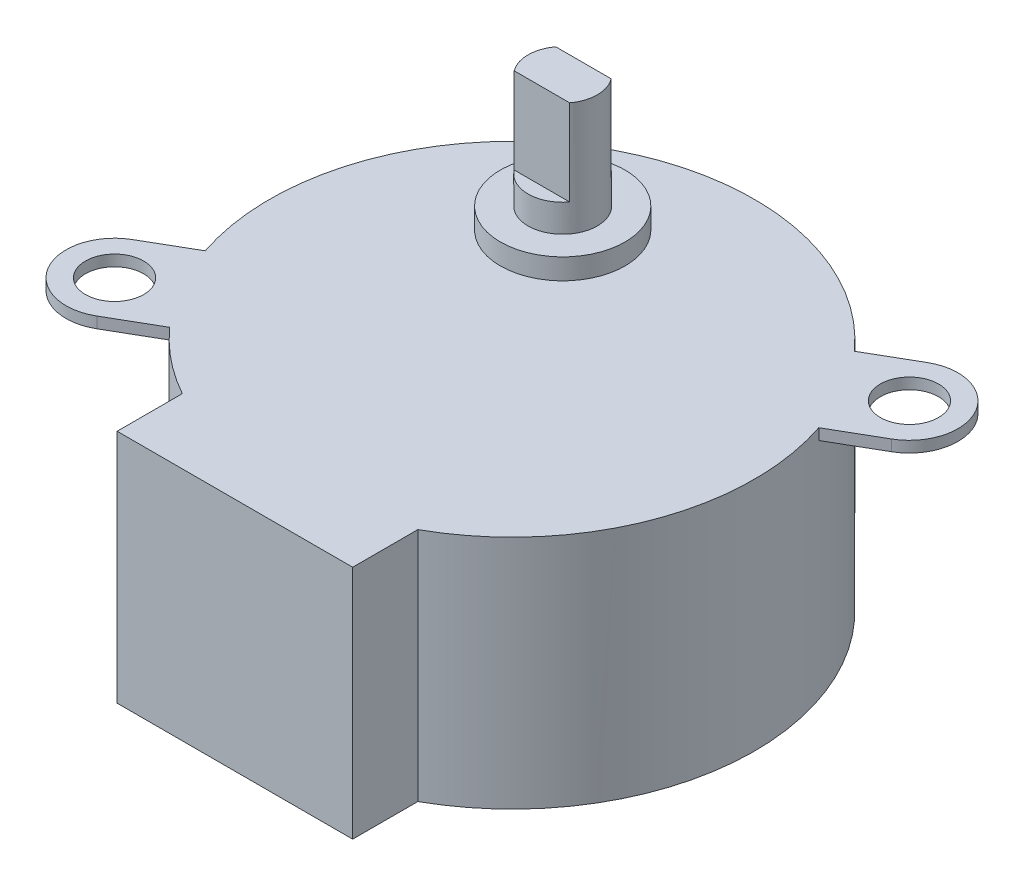
ISO-10303-21;
HEADER;
FILE_DESCRIPTION(('STEP AP214'),'2;1');
FILE_NAME('part.step','',(''),(''),'','','');
FILE_SCHEMA(('AUTOMOTIVE_DESIGN { 1 0 10303 214 1 1 1 1 }'));
ENDSEC;
DATA;
#1=APPLICATION_CONTEXT('core data for automotive mechanical design processes');
#2=APPLICATION_PROTOCOL_DEFINITION('international standard','automotive_design',2000,#1);
#3=PRODUCT_CONTEXT('',#1,'mechanical');
#4=PRODUCT('Part','Part','',(#3));
#5=PRODUCT_RELATED_PRODUCT_CATEGORY('part','',(#4));
#6=PRODUCT_DEFINITION_FORMATION('','',#4);
#7=PRODUCT_DEFINITION_CONTEXT('part definition',#1,'design');
#8=PRODUCT_DEFINITION('design','',#6,#7);
#9=PRODUCT_DEFINITION_SHAPE('','',#8);
#10=(LENGTH_UNIT() NAMED_UNIT(*) SI_UNIT(.MILLI.,.METRE.));
#11=(NAMED_UNIT(*) PLANE_ANGLE_UNIT() SI_UNIT($,.RADIAN.));
#12=(NAMED_UNIT(*) SI_UNIT($,.STERADIAN.) SOLID_ANGLE_UNIT());
#13=UNCERTAINTY_MEASURE_WITH_UNIT(LENGTH_MEASURE(1.E-05),#10,'distance_accuracy_value','');
#14=(GEOMETRIC_REPRESENTATION_CONTEXT(3) GLOBAL_UNCERTAINTY_ASSIGNED_CONTEXT((#13)) GLOBAL_UNIT_ASSIGNED_CONTEXT((#10,
#11,#12)) REPRESENTATION_CONTEXT('',''));
#15=CARTESIAN_POINT('',(0.,0.,0.));
#16=DIRECTION('',(0.,0.,1.));
#17=DIRECTION('',(1.,0.,0.));
#18=AXIS2_PLACEMENT_3D('',#15,#16,#17);
#19=CARTESIAN_POINT('',(-5.00000000000001,20.5,-8.66025403784438));
#20=DIRECTION('',(0.,1.,0.));
#21=DIRECTION('',(0.,0.,1.));
#22=AXIS2_PLACEMENT_3D('',#19,#20,#21);
#23=PLANE('',#22);
#24=DIRECTION('',(-1.,0.,0.));
#25=VECTOR('',#24,1.);
#26=CARTESIAN_POINT('',(-7.00000000000002,20.5,-10.1602540378444));
#27=LINE('',#26,#25);
#28=CARTESIAN_POINT('',(-3.00000000000001,20.5,-10.1602540378444));
#29=VERTEX_POINT('',#28);
#30=CARTESIAN_POINT('',(-7.00000000000001,20.5,-10.1602540378444));
#31=VERTEX_POINT('',#30);
#32=EDGE_CURVE('E180',#29,#31,#27,.T.);
#33=ORIENTED_EDGE('',*,*,#32,.F.);
#34=CARTESIAN_POINT('',(-5.00000000000001,20.5,-8.66025403784438));
#35=DIRECTION('',(0.,1.,0.));
#36=DIRECTION('',(0.,0.,1.));
#37=AXIS2_PLACEMENT_3D('',#34,#35,#36);
#38=CIRCLE('',#37,2.5);
#39=EDGE_CURVE('E67',#29,#31,#38,.T.);
#40=ORIENTED_EDGE('',*,*,#39,.T.);
#41=EDGE_LOOP('',(#33,#40));
#42=FACE_BOUND('',#41,.T.);
#43=ADVANCED_FACE('F44',(#42),#23,.T.);
#44=CARTESIAN_POINT('',(0.,0.,0.));
#45=DIRECTION('',(0.,1.,0.));
#46=DIRECTION('',(0.,0.,1.));
#47=AXIS2_PLACEMENT_3D('',#44,#45,#46);
#48=PLANE('',#47);
#49=CARTESIAN_POINT('',(0.,0.,0.));
#50=DIRECTION('',(0.,1.,0.));
#51=DIRECTION('',(0.,0.,1.));
#52=AXIS2_PLACEMENT_3D('',#49,#50,#51);
#53=CIRCLE('',#52,17.5);
#54=CARTESIAN_POINT('',(8.5,0.,15.2970585407784));
#55=VERTEX_POINT('',#54);
#56=CARTESIAN_POINT('',(-8.5,0.,15.2970585407784));
#57=VERTEX_POINT('',#56);
#58=EDGE_CURVE('E250',#55,#57,#53,.T.);
#59=ORIENTED_EDGE('',*,*,#58,.F.);
#60=DIRECTION('',(0.,0.,-1.));
#61=VECTOR('',#60,1.);
#62=CARTESIAN_POINT('',(8.5,0.,15.2970585407784));
#63=LINE('',#62,#61);
#64=CARTESIAN_POINT('',(8.5,0.,20.));
#65=VERTEX_POINT('',#64);
#66=EDGE_CURVE('E289',#65,#55,#63,.T.);
#67=ORIENTED_EDGE('',*,*,#66,.F.);
#68=DIRECTION('',(1.,0.,0.));
#69=VECTOR('',#68,1.);
#70=CARTESIAN_POINT('',(-8.5,0.,20.));
#71=LINE('',#70,#69);
#72=CARTESIAN_POINT('',(-8.5,0.,20.));
#73=VERTEX_POINT('',#72);
#74=EDGE_CURVE('E286',#73,#65,#71,.T.);
#75=ORIENTED_EDGE('',*,*,#74,.F.);
#76=DIRECTION('',(0.,0.,1.));
#77=VECTOR('',#76,1.);
#78=CARTESIAN_POINT('',(-8.5,0.,15.2970585407784));
#79=LINE('',#78,#77);
#80=EDGE_CURVE('E244',#57,#73,#79,.T.);
#81=ORIENTED_EDGE('',*,*,#80,.F.);
#82=EDGE_LOOP('',(#59,#67,#75,#81));
#83=FACE_BOUND('',#82,.T.);
#84=ADVANCED_FACE('F352',(#83),#48,.F.);
#85=CARTESIAN_POINT('',(16.5992424049175,17.,-5.54212518649561));
#86=DIRECTION('',(-0.500000000000001,0.,-0.866025403784438));
#87=DIRECTION('',(-0.866025403784438,0.,0.500000000000001));
#88=AXIS2_PLACEMENT_3D('',#85,#86,#87);
#89=PLANE('',#88);
#90=DIRECTION('',(-0.866025403784438,0.,0.500000000000001));
#91=VECTOR('',#90,1.);
#92=CARTESIAN_POINT('',(1.75,16.2,3.03108891324553));
#93=LINE('',#92,#91);
#94=CARTESIAN_POINT('',(19.9365334794732,16.2,-7.46891108675449));
#95=VERTEX_POINT('',#94);
#96=CARTESIAN_POINT('',(16.5992424049175,16.2,-5.54212518649561));
#97=VERTEX_POINT('',#96);
#98=EDGE_CURVE('E200',#95,#97,#93,.T.);
#99=ORIENTED_EDGE('',*,*,#98,.F.);
#100=DIRECTION('',(0.,-1.,0.));
#101=VECTOR('',#100,1.);
#102=CARTESIAN_POINT('',(19.9365334794732,17.,-7.46891108675449));
#103=LINE('',#102,#101);
#104=CARTESIAN_POINT('',(19.9365334794732,17.,-7.46891108675449));
#105=VERTEX_POINT('',#104);
#106=EDGE_CURVE('E318',#105,#95,#103,.T.);
#107=ORIENTED_EDGE('',*,*,#106,.F.);
#108=DIRECTION('',(0.866025403784438,0.,-0.500000000000001));
#109=VECTOR('',#108,1.);
#110=CARTESIAN_POINT('',(16.5992424049175,17.,-5.54212518649561));
#111=LINE('',#110,#109);
#112=CARTESIAN_POINT('',(16.5992424049175,17.,-5.54212518649561));
#113=VERTEX_POINT('',#112);
#114=EDGE_CURVE('E262',#113,#105,#111,.T.);
#115=ORIENTED_EDGE('',*,*,#114,.F.);
#116=DIRECTION('',(0.,-1.,0.));
#117=VECTOR('',#116,1.);
#118=CARTESIAN_POINT('',(16.5992424049175,17.,-5.54212518649561));
#119=LINE('',#118,#117);
#120=EDGE_CURVE('E322',#113,#97,#119,.T.);
#121=ORIENTED_EDGE('',*,*,#120,.T.);
#122=EDGE_LOOP('',(#99,#107,#115,#121));
#123=FACE_BOUND('',#122,.T.);
#124=ADVANCED_FACE('F396',(#123),#89,.F.);
#125=CARTESIAN_POINT('',(18.1865334794732,17.,-10.5));
#126=DIRECTION('',(0.,-1.,0.));
#127=DIRECTION('',(0.,0.,-1.));
#128=AXIS2_PLACEMENT_3D('',#125,#126,#127);
#129=CYLINDRICAL_SURFACE('',#128,3.5);
#130=CARTESIAN_POINT('',(18.1865334794732,16.2,-10.5));
#131=DIRECTION('',(0.,-1.,0.));
#132=DIRECTION('',(0.,0.,-1.));
#133=AXIS2_PLACEMENT_3D('',#130,#131,#132);
#134=CIRCLE('',#133,3.5);
#135=CARTESIAN_POINT('',(16.4365334794732,16.2,-13.5310889132456));
#136=VERTEX_POINT('',#135);
#137=EDGE_CURVE('E211',#136,#95,#134,.T.);
#138=ORIENTED_EDGE('',*,*,#137,.F.);
#139=DIRECTION('',(0.,-1.,0.));
#140=VECTOR('',#139,1.);
#141=CARTESIAN_POINT('',(16.4365334794732,17.,-13.5310889132456));
#142=LINE('',#141,#140);
#143=CARTESIAN_POINT('',(16.4365334794732,17.,-13.5310889132456));
#144=VERTEX_POINT('',#143);
#145=EDGE_CURVE('E314',#144,#136,#142,.T.);
#146=ORIENTED_EDGE('',*,*,#145,.F.);
#147=CARTESIAN_POINT('',(18.1865334794732,17.,-10.5));
#148=DIRECTION('',(0.,1.,0.));
#149=DIRECTION('',(0.,0.,1.));
#150=AXIS2_PLACEMENT_3D('',#147,#148,#149);
#151=CIRCLE('',#150,3.5);
#152=EDGE_CURVE('E265',#105,#144,#151,.T.);
#153=ORIENTED_EDGE('',*,*,#152,.F.);
#154=ORIENTED_EDGE('',*,*,#106,.T.);
#155=EDGE_LOOP('',(#138,#146,#153,#154));
#156=FACE_BOUND('',#155,.T.);
#157=ADVANCED_FACE('F391',(#156),#129,.T.);
#158=CARTESIAN_POINT('',(13.0992424049175,17.,-11.6043030129867));
#159=DIRECTION('',(0.500000000000002,0.,0.866025403784438));
#160=DIRECTION('',(0.866025403784438,0.,-0.500000000000002));
#161=AXIS2_PLACEMENT_3D('',#158,#159,#160);
#162=PLANE('',#161);
#163=DIRECTION('',(0.866025403784438,0.,-0.500000000000002));
#164=VECTOR('',#163,1.);
#165=CARTESIAN_POINT('',(-1.75,16.2,-3.03108891324552));
#166=LINE('',#165,#164);
#167=CARTESIAN_POINT('',(13.0992424049175,16.2,-11.6043030129867));
#168=VERTEX_POINT('',#167);
#169=EDGE_CURVE('E208',#168,#136,#166,.T.);
#170=ORIENTED_EDGE('',*,*,#169,.F.);
#171=DIRECTION('',(0.,-1.,0.));
#172=VECTOR('',#171,1.);
#173=CARTESIAN_POINT('',(13.0992424049175,17.,-11.6043030129867));
#174=LINE('',#173,#172);
#175=CARTESIAN_POINT('',(13.0992424049175,17.,-11.6043030129867));
#176=VERTEX_POINT('',#175);
#177=EDGE_CURVE('E310',#176,#168,#174,.T.);
#178=ORIENTED_EDGE('',*,*,#177,.F.);
#179=DIRECTION('',(-0.866025403784438,0.,0.500000000000002));
#180=VECTOR('',#179,1.);
#181=CARTESIAN_POINT('',(13.0992424049175,17.,-11.6043030129867));
#182=LINE('',#181,#180);
#183=EDGE_CURVE('E268',#144,#176,#182,.T.);
#184=ORIENTED_EDGE('',*,*,#183,.F.);
#185=ORIENTED_EDGE('',*,*,#145,.T.);
#186=EDGE_LOOP('',(#170,#178,#184,#185));
#187=FACE_BOUND('',#186,.T.);
#188=ADVANCED_FACE('F384',(#187),#162,.F.);
#189=CARTESIAN_POINT('',(-19.9365334794732,17.,7.4689110867545));
#190=DIRECTION('',(0.500000000000001,0.,0.866025403784438));
#191=DIRECTION('',(0.866025403784438,0.,-0.500000000000001));
#192=AXIS2_PLACEMENT_3D('',#189,#190,#191);
#193=PLANE('',#192);
#194=DIRECTION('',(0.866025403784438,0.,-0.500000000000001));
#195=VECTOR('',#194,1.);
#196=CARTESIAN_POINT('',(-1.75000000000001,16.2,-3.03108891324553));
#197=LINE('',#196,#195);
#198=CARTESIAN_POINT('',(-19.9365334794732,16.2,7.4689110867545));
#199=VERTEX_POINT('',#198);
#200=CARTESIAN_POINT('',(-16.5992424049175,16.2,5.54212518649561));
#201=VERTEX_POINT('',#200);
#202=EDGE_CURVE('E219',#199,#201,#197,.T.);
#203=ORIENTED_EDGE('',*,*,#202,.F.);
#204=DIRECTION('',(0.,-1.,0.));
#205=VECTOR('',#204,1.);
#206=CARTESIAN_POINT('',(-19.9365334794732,17.,7.4689110867545));
#207=LINE('',#206,#205);
#208=CARTESIAN_POINT('',(-19.9365334794732,17.,7.4689110867545));
#209=VERTEX_POINT('',#208);
#210=EDGE_CURVE('E302',#209,#199,#207,.T.);
#211=ORIENTED_EDGE('',*,*,#210,.F.);
#212=DIRECTION('',(-0.866025403784438,0.,0.500000000000001));
#213=VECTOR('',#212,1.);
#214=CARTESIAN_POINT('',(-19.9365334794732,17.,7.4689110867545));
#215=LINE('',#214,#213);
#216=CARTESIAN_POINT('',(-16.5992424049175,17.,5.54212518649561));
#217=VERTEX_POINT('',#216);
#218=EDGE_CURVE('E274',#217,#209,#215,.T.);
#219=ORIENTED_EDGE('',*,*,#218,.F.);
#220=DIRECTION('',(0.,-1.,0.));
#221=VECTOR('',#220,1.);
#222=CARTESIAN_POINT('',(-16.5992424049175,17.,5.54212518649561));
#223=LINE('',#222,#221);
#224=EDGE_CURVE('E306',#217,#201,#223,.T.);
#225=ORIENTED_EDGE('',*,*,#224,.T.);
#226=EDGE_LOOP('',(#203,#211,#219,#225));
#227=FACE_BOUND('',#226,.T.);
#228=ADVANCED_FACE('F379',(#227),#193,.F.);
#229=CARTESIAN_POINT('',(-18.1865334794732,17.,10.5));
#230=DIRECTION('',(0.,-1.,0.));
#231=DIRECTION('',(0.,0.,-1.));
#232=AXIS2_PLACEMENT_3D('',#229,#230,#231);
#233=CYLINDRICAL_SURFACE('',#232,3.5);
#234=CARTESIAN_POINT('',(-18.1865334794732,16.2,10.5));
#235=DIRECTION('',(0.,-1.,0.));
#236=DIRECTION('',(0.,0.,-1.));
#237=AXIS2_PLACEMENT_3D('',#234,#235,#236);
#238=CIRCLE('',#237,3.5);
#239=CARTESIAN_POINT('',(-16.4365334794732,16.2,13.5310889132456));
#240=VERTEX_POINT('',#239);
#241=EDGE_CURVE('E216',#240,#199,#238,.T.);
#242=ORIENTED_EDGE('',*,*,#241,.F.);
#243=DIRECTION('',(0.,-1.,0.));
#244=VECTOR('',#243,1.);
#245=CARTESIAN_POINT('',(-16.4365334794732,17.,13.5310889132456));
#246=LINE('',#245,#244);
#247=CARTESIAN_POINT('',(-16.4365334794732,17.,13.5310889132456));
#248=VERTEX_POINT('',#247);
#249=EDGE_CURVE('E298',#248,#240,#246,.T.);
#250=ORIENTED_EDGE('',*,*,#249,.F.);
#251=CARTESIAN_POINT('',(-18.1865334794732,17.,10.5));
#252=DIRECTION('',(0.,1.,0.));
#253=DIRECTION('',(0.,0.,1.));
#254=AXIS2_PLACEMENT_3D('',#251,#252,#253);
#255=CIRCLE('',#254,3.5);
#256=EDGE_CURVE('E277',#209,#248,#255,.T.);
#257=ORIENTED_EDGE('',*,*,#256,.F.);
#258=ORIENTED_EDGE('',*,*,#210,.T.);
#259=EDGE_LOOP('',(#242,#250,#257,#258));
#260=FACE_BOUND('',#259,.T.);
#261=ADVANCED_FACE('F446',(#260),#233,.T.);
#262=CARTESIAN_POINT('',(-16.4365334794732,17.,13.5310889132456));
#263=DIRECTION('',(-0.500000000000002,0.,-0.866025403784438));
#264=DIRECTION('',(-0.866025403784438,0.,0.500000000000002));
#265=AXIS2_PLACEMENT_3D('',#262,#263,#264);
#266=PLANE('',#265);
#267=DIRECTION('',(-0.866025403784438,0.,0.500000000000002));
#268=VECTOR('',#267,1.);
#269=CARTESIAN_POINT('',(1.75,16.2,3.03108891324552));
#270=LINE('',#269,#268);
#271=CARTESIAN_POINT('',(-13.0992424049175,16.2,11.6043030129867));
#272=VERTEX_POINT('',#271);
#273=EDGE_CURVE('E190',#272,#240,#270,.T.);
#274=ORIENTED_EDGE('',*,*,#273,.F.);
#275=DIRECTION('',(0.,-1.,0.));
#276=VECTOR('',#275,1.);
#277=CARTESIAN_POINT('',(-13.0992424049175,17.,11.6043030129867));
#278=LINE('',#277,#276);
#279=CARTESIAN_POINT('',(-13.0992424049175,17.,11.6043030129867));
#280=VERTEX_POINT('',#279);
#281=EDGE_CURVE('E283',#280,#272,#278,.T.);
#282=ORIENTED_EDGE('',*,*,#281,.F.);
#283=DIRECTION('',(0.866025403784438,0.,-0.500000000000002));
#284=VECTOR('',#283,1.);
#285=CARTESIAN_POINT('',(-16.4365334794732,17.,13.5310889132456));
#286=LINE('',#285,#284);
#287=EDGE_CURVE('E280',#248,#280,#286,.T.);
#288=ORIENTED_EDGE('',*,*,#287,.F.);
#289=ORIENTED_EDGE('',*,*,#249,.T.);
#290=EDGE_LOOP('',(#274,#282,#288,#289));
#291=FACE_BOUND('',#290,.T.);
#292=ADVANCED_FACE('F368',(#291),#266,.F.);
#293=CARTESIAN_POINT('',(-18.1865334794732,17.,10.5));
#294=DIRECTION('',(0.,-1.,0.));
#295=DIRECTION('',(0.,0.,-1.));
#296=AXIS2_PLACEMENT_3D('',#293,#294,#295);
#297=CYLINDRICAL_SURFACE('',#296,2.1);
#298=CARTESIAN_POINT('',(-18.1865334794732,17.,10.5));
#299=DIRECTION('',(0.,1.,0.));
#300=DIRECTION('',(0.,0.,1.));
#301=AXIS2_PLACEMENT_3D('',#298,#299,#300);
#302=CIRCLE('',#301,2.1);
#303=CARTESIAN_POINT('',(-18.1865334794732,17.,12.6));
#304=VERTEX_POINT('',#303);
#305=EDGE_CURVE('E240',#304,#304,#302,.T.);
#306=ORIENTED_EDGE('',*,*,#305,.T.);
#307=EDGE_LOOP('',(#306));
#308=FACE_BOUND('',#307,.T.);
#309=CARTESIAN_POINT('',(-18.1865334794732,16.2,10.5));
#310=DIRECTION('',(0.,-1.,0.));
#311=DIRECTION('',(0.,0.,-1.));
#312=AXIS2_PLACEMENT_3D('',#309,#310,#311);
#313=CIRCLE('',#312,2.1);
#314=CARTESIAN_POINT('',(-18.1865334794732,16.2,8.40000000000003));
#315=VERTEX_POINT('',#314);
#316=EDGE_CURVE('E201',#315,#315,#313,.F.);
#317=ORIENTED_EDGE('',*,*,#316,.F.);
#318=EDGE_LOOP('',(#317));
#319=FACE_BOUND('',#318,.T.);
#320=ADVANCED_FACE('F436',(#308,#319),#297,.F.);
#321=CARTESIAN_POINT('',(18.1865334794732,17.,-10.5));
#322=DIRECTION('',(0.,-1.,0.));
#323=DIRECTION('',(0.,0.,-1.));
#324=AXIS2_PLACEMENT_3D('',#321,#322,#323);
#325=CYLINDRICAL_SURFACE('',#324,2.1);
#326=CARTESIAN_POINT('',(18.1865334794732,17.,-10.5));
#327=DIRECTION('',(0.,1.,0.));
#328=DIRECTION('',(0.,0.,1.));
#329=AXIS2_PLACEMENT_3D('',#326,#327,#328);
#330=CIRCLE('',#329,2.1);
#331=CARTESIAN_POINT('',(18.1865334794732,17.,-8.40000000000003));
#332=VERTEX_POINT('',#331);
#333=EDGE_CURVE('E232',#332,#332,#330,.T.);
#334=ORIENTED_EDGE('',*,*,#333,.T.);
#335=EDGE_LOOP('',(#334));
#336=FACE_BOUND('',#335,.T.);
#337=CARTESIAN_POINT('',(18.1865334794732,16.2,-10.5));
#338=DIRECTION('',(0.,-1.,0.));
#339=DIRECTION('',(0.,0.,-1.));
#340=AXIS2_PLACEMENT_3D('',#337,#338,#339);
#341=CIRCLE('',#340,2.1);
#342=CARTESIAN_POINT('',(18.1865334794732,16.2,-12.6));
#343=VERTEX_POINT('',#342);
#344=EDGE_CURVE('E196',#343,#343,#341,.F.);
#345=ORIENTED_EDGE('',*,*,#344,.F.);
#346=EDGE_LOOP('',(#345));
#347=FACE_BOUND('',#346,.T.);
#348=ADVANCED_FACE('F433',(#336,#347),#325,.F.);
#349=CARTESIAN_POINT('',(0.,17.,0.));
#350=DIRECTION('',(0.,1.,0.));
#351=DIRECTION('',(0.,0.,1.));
#352=AXIS2_PLACEMENT_3D('',#349,#350,#351);
#353=PLANE('',#352);
#354=CARTESIAN_POINT('',(-5.00000000000001,17.,-8.66025403784438));
#355=DIRECTION('',(0.,1.,0.));
#356=DIRECTION('',(0.,0.,1.));
#357=AXIS2_PLACEMENT_3D('',#354,#355,#356);
#358=CIRCLE('',#357,4.5);
#359=CARTESIAN_POINT('',(-5.00000000000001,17.,-4.16025403784438));
#360=VERTEX_POINT('',#359);
#361=EDGE_CURVE('E233',#360,#360,#358,.T.);
#362=ORIENTED_EDGE('',*,*,#361,.F.);
#363=EDGE_LOOP('',(#362));
#364=FACE_BOUND('',#363,.T.);
#365=ORIENTED_EDGE('',*,*,#305,.F.);
#366=EDGE_LOOP('',(#365));
#367=FACE_BOUND('',#366,.T.);
#368=CARTESIAN_POINT('',(0.,17.,0.));
#369=DIRECTION('',(0.,1.,0.));
#370=DIRECTION('',(0.,0.,1.));
#371=AXIS2_PLACEMENT_3D('',#368,#369,#370);
#372=CIRCLE('',#371,17.5);
#373=CARTESIAN_POINT('',(-8.5,17.,15.2970585407784));
#374=VERTEX_POINT('',#373);
#375=EDGE_CURVE('E245',#280,#374,#372,.T.);
#376=ORIENTED_EDGE('',*,*,#375,.T.);
#377=DIRECTION('',(0.,0.,1.));
#378=VECTOR('',#377,1.);
#379=CARTESIAN_POINT('',(-8.5,17.,15.2970585407784));
#380=LINE('',#379,#378);
#381=CARTESIAN_POINT('',(-8.5,17.,20.));
#382=VERTEX_POINT('',#381);
#383=EDGE_CURVE('E249',#374,#382,#380,.T.);
#384=ORIENTED_EDGE('',*,*,#383,.T.);
#385=DIRECTION('',(1.,0.,0.));
#386=VECTOR('',#385,1.);
#387=CARTESIAN_POINT('',(-8.5,17.,20.));
#388=LINE('',#387,#386);
#389=CARTESIAN_POINT('',(8.5,17.,20.));
#390=VERTEX_POINT('',#389);
#391=EDGE_CURVE('E253',#382,#390,#388,.T.);
#392=ORIENTED_EDGE('',*,*,#391,.T.);
#393=DIRECTION('',(0.,0.,-1.));
#394=VECTOR('',#393,1.);
#395=CARTESIAN_POINT('',(8.5,17.,15.2970585407784));
#396=LINE('',#395,#394);
#397=CARTESIAN_POINT('',(8.5,17.,15.2970585407784));
#398=VERTEX_POINT('',#397);
#399=EDGE_CURVE('E256',#390,#398,#396,.T.);
#400=ORIENTED_EDGE('',*,*,#399,.T.);
#401=CARTESIAN_POINT('',(0.,17.,0.));
#402=DIRECTION('',(0.,1.,0.));
#403=DIRECTION('',(0.,0.,1.));
#404=AXIS2_PLACEMENT_3D('',#401,#402,#403);
#405=CIRCLE('',#404,17.5);
#406=EDGE_CURVE('E259',#398,#113,#405,.T.);
#407=ORIENTED_EDGE('',*,*,#406,.T.);
#408=ORIENTED_EDGE('',*,*,#114,.T.);
#409=ORIENTED_EDGE('',*,*,#152,.T.);
#410=ORIENTED_EDGE('',*,*,#183,.T.);
#411=CARTESIAN_POINT('',(0.,17.,0.));
#412=DIRECTION('',(0.,1.,0.));
#413=DIRECTION('',(0.,0.,1.));
#414=AXIS2_PLACEMENT_3D('',#411,#412,#413);
#415=CIRCLE('',#414,17.5);
#416=EDGE_CURVE('E271',#176,#217,#415,.T.);
#417=ORIENTED_EDGE('',*,*,#416,.T.);
#418=ORIENTED_EDGE('',*,*,#218,.T.);
#419=ORIENTED_EDGE('',*,*,#256,.T.);
#420=ORIENTED_EDGE('',*,*,#287,.T.);
#421=EDGE_LOOP('',(#376,#384,#392,#400,#407,#408,#409,#410,#417,#418,#419,#420));
#422=FACE_BOUND('',#421,.T.);
#423=ORIENTED_EDGE('',*,*,#333,.F.);
#424=EDGE_LOOP('',(#423));
#425=FACE_BOUND('',#424,.T.);
#426=ADVANCED_FACE('F359',(#364,#367,#422,#425),#353,.T.);
#427=CARTESIAN_POINT('',(-8.5,17.,15.2970585407784));
#428=DIRECTION('',(1.,0.,0.));
#429=DIRECTION('',(0.,0.,-1.));
#430=AXIS2_PLACEMENT_3D('',#427,#428,#429);
#431=PLANE('',#430);
#432=ORIENTED_EDGE('',*,*,#80,.T.);
#433=DIRECTION('',(0.,-1.,0.));
#434=VECTOR('',#433,1.);
#435=CARTESIAN_POINT('',(-8.5,17.,20.));
#436=LINE('',#435,#434);
#437=EDGE_CURVE('E333',#382,#73,#436,.T.);
#438=ORIENTED_EDGE('',*,*,#437,.F.);
#439=ORIENTED_EDGE('',*,*,#383,.F.);
#440=DIRECTION('',(0.,-1.,0.));
#441=VECTOR('',#440,1.);
#442=CARTESIAN_POINT('',(-8.5,17.,15.2970585407784));
#443=LINE('',#442,#441);
#444=EDGE_CURVE('E48',#374,#57,#443,.T.);
#445=ORIENTED_EDGE('',*,*,#444,.T.);
#446=EDGE_LOOP('',(#432,#438,#439,#445));
#447=FACE_BOUND('',#446,.T.);
#448=ADVANCED_FACE('F46',(#447),#431,.F.);
#449=CARTESIAN_POINT('',(-8.5,17.,20.));
#450=DIRECTION('',(0.,0.,-1.));
#451=DIRECTION('',(-1.,0.,0.));
#452=AXIS2_PLACEMENT_3D('',#449,#450,#451);
#453=PLANE('',#452);
#454=ORIENTED_EDGE('',*,*,#74,.T.);
#455=DIRECTION('',(0.,-1.,0.));
#456=VECTOR('',#455,1.);
#457=CARTESIAN_POINT('',(8.5,17.,20.));
#458=LINE('',#457,#456);
#459=EDGE_CURVE('E330',#390,#65,#458,.T.);
#460=ORIENTED_EDGE('',*,*,#459,.F.);
#461=ORIENTED_EDGE('',*,*,#391,.F.);
#462=ORIENTED_EDGE('',*,*,#437,.T.);
#463=EDGE_LOOP('',(#454,#460,#461,#462));
#464=FACE_BOUND('',#463,.T.);
#465=ADVANCED_FACE('F354',(#464),#453,.F.);
#466=CARTESIAN_POINT('',(8.5,17.,15.2970585407784));
#467=DIRECTION('',(-1.,0.,0.));
#468=DIRECTION('',(0.,0.,1.));
#469=AXIS2_PLACEMENT_3D('',#466,#467,#468);
#470=PLANE('',#469);
#471=ORIENTED_EDGE('',*,*,#66,.T.);
#472=DIRECTION('',(0.,-1.,0.));
#473=VECTOR('',#472,1.);
#474=CARTESIAN_POINT('',(8.5,17.,15.2970585407784));
#475=LINE('',#474,#473);
#476=EDGE_CURVE('E326',#398,#55,#475,.T.);
#477=ORIENTED_EDGE('',*,*,#476,.F.);
#478=ORIENTED_EDGE('',*,*,#399,.F.);
#479=ORIENTED_EDGE('',*,*,#459,.T.);
#480=EDGE_LOOP('',(#471,#477,#478,#479));
#481=FACE_BOUND('',#480,.T.);
#482=ADVANCED_FACE('F357',(#481),#470,.F.);
#483=CARTESIAN_POINT('',(0.,17.,0.));
#484=DIRECTION('',(0.,-1.,0.));
#485=DIRECTION('',(0.,0.,-1.));
#486=AXIS2_PLACEMENT_3D('',#483,#484,#485);
#487=CYLINDRICAL_SURFACE('',#486,17.5);
#488=ORIENTED_EDGE('',*,*,#58,.T.);
#489=ORIENTED_EDGE('',*,*,#444,.F.);
#490=ORIENTED_EDGE('',*,*,#375,.F.);
#491=ORIENTED_EDGE('',*,*,#281,.T.);
#492=CARTESIAN_POINT('',(0.,16.2,0.));
#493=DIRECTION('',(0.,-1.,0.));
#494=DIRECTION('',(0.,0.,-1.));
#495=AXIS2_PLACEMENT_3D('',#492,#493,#494);
#496=CIRCLE('',#495,17.5);
#497=EDGE_CURVE('E186',#272,#201,#496,.T.);
#498=ORIENTED_EDGE('',*,*,#497,.T.);
#499=ORIENTED_EDGE('',*,*,#224,.F.);
#500=ORIENTED_EDGE('',*,*,#416,.F.);
#501=ORIENTED_EDGE('',*,*,#177,.T.);
#502=CARTESIAN_POINT('',(0.,16.2,0.));
#503=DIRECTION('',(0.,-1.,0.));
#504=DIRECTION('',(0.,0.,-1.));
#505=AXIS2_PLACEMENT_3D('',#502,#503,#504);
#506=CIRCLE('',#505,17.5);
#507=EDGE_CURVE('E205',#97,#168,#506,.F.);
#508=ORIENTED_EDGE('',*,*,#507,.F.);
#509=ORIENTED_EDGE('',*,*,#120,.F.);
#510=ORIENTED_EDGE('',*,*,#406,.F.);
#511=ORIENTED_EDGE('',*,*,#476,.T.);
#512=EDGE_LOOP('',(#488,#489,#490,#491,#498,#499,#500,#501,#508,#509,#510,#511));
#513=FACE_BOUND('',#512,.T.);
#514=ADVANCED_FACE('F347',(#513),#487,.T.);
#515=CARTESIAN_POINT('',(-5.00000000000001,18.5,-8.66025403784438));
#516=DIRECTION('',(0.,-1.,0.));
#517=DIRECTION('',(0.,0.,-1.));
#518=AXIS2_PLACEMENT_3D('',#515,#516,#517);
#519=CYLINDRICAL_SURFACE('',#518,4.5);
#520=CARTESIAN_POINT('',(-5.00000000000001,18.5,-8.66025403784438));
#521=DIRECTION('',(0.,1.,0.));
#522=DIRECTION('',(0.,0.,1.));
#523=AXIS2_PLACEMENT_3D('',#520,#521,#522);
#524=CIRCLE('',#523,4.5);
#525=CARTESIAN_POINT('',(-5.00000000000001,18.5,-4.16025403784438));
#526=VERTEX_POINT('',#525);
#527=EDGE_CURVE('E228',#526,#526,#524,.T.);
#528=ORIENTED_EDGE('',*,*,#527,.F.);
#529=EDGE_LOOP('',(#528));
#530=FACE_BOUND('',#529,.T.);
#531=ORIENTED_EDGE('',*,*,#361,.T.);
#532=EDGE_LOOP('',(#531));
#533=FACE_BOUND('',#532,.T.);
#534=ADVANCED_FACE('F426',(#530,#533),#519,.T.);
#535=CARTESIAN_POINT('',(-5.00000000000001,18.5,-8.66025403784438));
#536=DIRECTION('',(0.,1.,0.));
#537=DIRECTION('',(0.,0.,1.));
#538=AXIS2_PLACEMENT_3D('',#535,#536,#537);
#539=PLANE('',#538);
#540=CARTESIAN_POINT('',(-5.00000000000001,18.5,-8.66025403784438));
#541=DIRECTION('',(0.,1.,0.));
#542=DIRECTION('',(0.,0.,1.));
#543=AXIS2_PLACEMENT_3D('',#540,#541,#542);
#544=CIRCLE('',#543,2.5);
#545=CARTESIAN_POINT('',(-5.00000000000001,18.5,-6.16025403784438));
#546=VERTEX_POINT('',#545);
#547=EDGE_CURVE('E11',#546,#546,#544,.T.);
#548=ORIENTED_EDGE('',*,*,#547,.F.);
#549=EDGE_LOOP('',(#548));
#550=FACE_BOUND('',#549,.T.);
#551=ORIENTED_EDGE('',*,*,#527,.T.);
#552=EDGE_LOOP('',(#551));
#553=FACE_BOUND('',#552,.T.);
#554=ADVANCED_FACE('F422',(#550,#553),#539,.T.);
#555=CARTESIAN_POINT('',(-5.00000000000001,20.5,-8.66025403784438));
#556=DIRECTION('',(0.,-1.,0.));
#557=DIRECTION('',(0.,0.,-1.));
#558=AXIS2_PLACEMENT_3D('',#555,#556,#557);
#559=CYLINDRICAL_SURFACE('',#558,2.5);
#560=ORIENTED_EDGE('',*,*,#39,.F.);
#561=DIRECTION('',(0.,-1.,0.));
#562=VECTOR('',#561,1.);
#563=CARTESIAN_POINT('',(-3.00000000000001,26.7,-10.1602540378444));
#564=LINE('',#563,#562);
#565=CARTESIAN_POINT('',(-3.00000000000001,26.7,-10.1602540378444));
#566=VERTEX_POINT('',#565);
#567=EDGE_CURVE('E192',#566,#29,#564,.T.);
#568=ORIENTED_EDGE('',*,*,#567,.F.);
#569=CARTESIAN_POINT('',(-5.00000000000001,26.7,-8.66025403784438));
#570=DIRECTION('',(0.,1.,0.));
#571=DIRECTION('',(0.,0.,1.));
#572=AXIS2_PLACEMENT_3D('',#569,#570,#571);
#573=CIRCLE('',#572,2.5);
#574=CARTESIAN_POINT('',(-3.00000000000001,26.7,-7.16025403784438));
#575=VERTEX_POINT('',#574);
#576=EDGE_CURVE('E169',#575,#566,#573,.T.);
#577=ORIENTED_EDGE('',*,*,#576,.F.);
#578=DIRECTION('',(0.,-1.,0.));
#579=VECTOR('',#578,1.);
#580=CARTESIAN_POINT('',(-3.00000000000001,26.7,-7.16025403784438));
#581=LINE('',#580,#579);
#582=CARTESIAN_POINT('',(-3.00000000000001,20.5,-7.16025403784438));
#583=VERTEX_POINT('',#582);
#584=EDGE_CURVE('E165',#575,#583,#581,.T.);
#585=ORIENTED_EDGE('',*,*,#584,.T.);
#586=CARTESIAN_POINT('',(-7.00000000000001,20.5,-7.16025403784438));
#587=VERTEX_POINT('',#586);
#588=EDGE_CURVE('E184',#587,#583,#38,.T.);
#589=ORIENTED_EDGE('',*,*,#588,.F.);
#590=DIRECTION('',(0.,-1.,0.));
#591=VECTOR('',#590,1.);
#592=CARTESIAN_POINT('',(-7.00000000000002,26.7,-7.16025403784438));
#593=LINE('',#592,#591);
#594=CARTESIAN_POINT('',(-7.00000000000002,26.7,-7.16025403784438));
#595=VERTEX_POINT('',#594);
#596=EDGE_CURVE('E163',#595,#587,#593,.T.);
#597=ORIENTED_EDGE('',*,*,#596,.F.);
#598=CARTESIAN_POINT('',(-5.00000000000001,26.7,-8.66025403784438));
#599=DIRECTION('',(0.,1.,0.));
#600=DIRECTION('',(0.,0.,1.));
#601=AXIS2_PLACEMENT_3D('',#598,#599,#600);
#602=CIRCLE('',#601,2.5);
#603=CARTESIAN_POINT('',(-7.00000000000002,26.7,-10.1602540378444));
#604=VERTEX_POINT('',#603);
#605=EDGE_CURVE('E170',#604,#595,#602,.T.);
#606=ORIENTED_EDGE('',*,*,#605,.F.);
#607=DIRECTION('',(0.,-1.,0.));
#608=VECTOR('',#607,1.);
#609=CARTESIAN_POINT('',(-7.00000000000002,26.7,-10.1602540378444));
#610=LINE('',#609,#608);
#611=EDGE_CURVE('E538',#604,#31,#610,.T.);
#612=ORIENTED_EDGE('',*,*,#611,.T.);
#613=EDGE_LOOP('',(#560,#568,#577,#585,#589,#597,#606,#612));
#614=FACE_BOUND('',#613,.T.);
#615=ORIENTED_EDGE('',*,*,#547,.T.);
#616=EDGE_LOOP('',(#615));
#617=FACE_BOUND('',#616,.T.);
#618=ADVANCED_FACE('F182',(#614,#617),#559,.T.);
#619=DIRECTION('',(1.,0.,0.));
#620=VECTOR('',#619,1.);
#621=CARTESIAN_POINT('',(-7.00000000000002,20.5,-7.16025403784438));
#622=LINE('',#621,#620);
#623=EDGE_CURVE('E60',#587,#583,#622,.T.);
#624=ORIENTED_EDGE('',*,*,#623,.F.);
#625=ORIENTED_EDGE('',*,*,#588,.T.);
#626=EDGE_LOOP('',(#624,#625));
#627=FACE_BOUND('',#626,.T.);
#628=ADVANCED_FACE('F408',(#627),#23,.T.);
#629=CARTESIAN_POINT('',(0.,16.2,0.));
#630=DIRECTION('',(0.,-1.,0.));
#631=DIRECTION('',(0.,0.,-1.));
#632=AXIS2_PLACEMENT_3D('',#629,#630,#631);
#633=PLANE('',#632);
#634=ORIENTED_EDGE('',*,*,#344,.T.);
#635=EDGE_LOOP('',(#634));
#636=FACE_BOUND('',#635,.T.);
#637=ORIENTED_EDGE('',*,*,#98,.T.);
#638=ORIENTED_EDGE('',*,*,#507,.T.);
#639=ORIENTED_EDGE('',*,*,#169,.T.);
#640=ORIENTED_EDGE('',*,*,#137,.T.);
#641=EDGE_LOOP('',(#637,#638,#639,#640));
#642=FACE_BOUND('',#641,.T.);
#643=ADVANCED_FACE('F388',(#636,#642),#633,.T.);
#644=CARTESIAN_POINT('',(0.,16.2,0.));
#645=DIRECTION('',(0.,-1.,0.));
#646=DIRECTION('',(0.,0.,-1.));
#647=AXIS2_PLACEMENT_3D('',#644,#645,#646);
#648=PLANE('',#647);
#649=ORIENTED_EDGE('',*,*,#497,.F.);
#650=ORIENTED_EDGE('',*,*,#273,.T.);
#651=ORIENTED_EDGE('',*,*,#241,.T.);
#652=ORIENTED_EDGE('',*,*,#202,.T.);
#653=EDGE_LOOP('',(#649,#650,#651,#652));
#654=FACE_BOUND('',#653,.T.);
#655=ORIENTED_EDGE('',*,*,#316,.T.);
#656=EDGE_LOOP('',(#655));
#657=FACE_BOUND('',#656,.T.);
#658=ADVANCED_FACE('F374',(#654,#657),#648,.T.);
#659=CARTESIAN_POINT('',(-7.00000000000002,26.7,-7.16025403784438));
#660=DIRECTION('',(0.,0.,-1.));
#661=DIRECTION('',(-1.,0.,0.));
#662=AXIS2_PLACEMENT_3D('',#659,#660,#661);
#663=PLANE('',#662);
#664=ORIENTED_EDGE('',*,*,#623,.T.);
#665=ORIENTED_EDGE('',*,*,#584,.F.);
#666=DIRECTION('',(1.,0.,0.));
#667=VECTOR('',#666,1.);
#668=CARTESIAN_POINT('',(-7.00000000000002,26.7,-7.16025403784438));
#669=LINE('',#668,#667);
#670=EDGE_CURVE('E159',#595,#575,#669,.T.);
#671=ORIENTED_EDGE('',*,*,#670,.F.);
#672=ORIENTED_EDGE('',*,*,#596,.T.);
#673=EDGE_LOOP('',(#664,#665,#671,#672));
#674=FACE_BOUND('',#673,.T.);
#675=ADVANCED_FACE('F161',(#674),#663,.F.);
#676=CARTESIAN_POINT('',(-7.00000000000002,26.7,-10.1602540378444));
#677=DIRECTION('',(0.,0.,1.));
#678=DIRECTION('',(1.,0.,0.));
#679=AXIS2_PLACEMENT_3D('',#676,#677,#678);
#680=PLANE('',#679);
#681=ORIENTED_EDGE('',*,*,#32,.T.);
#682=ORIENTED_EDGE('',*,*,#611,.F.);
#683=DIRECTION('',(-1.,0.,0.));
#684=VECTOR('',#683,1.);
#685=CARTESIAN_POINT('',(-7.00000000000002,26.7,-10.1602540378444));
#686=LINE('',#685,#684);
#687=EDGE_CURVE('E175',#566,#604,#686,.T.);
#688=ORIENTED_EDGE('',*,*,#687,.F.);
#689=ORIENTED_EDGE('',*,*,#567,.T.);
#690=EDGE_LOOP('',(#681,#682,#688,#689));
#691=FACE_BOUND('',#690,.T.);
#692=ADVANCED_FACE('F517',(#691),#680,.F.);
#693=CARTESIAN_POINT('',(-5.00000000000001,26.7,-8.66025403784438));
#694=DIRECTION('',(0.,1.,0.));
#695=DIRECTION('',(0.,0.,1.));
#696=AXIS2_PLACEMENT_3D('',#693,#694,#695);
#697=PLANE('',#696);
#698=ORIENTED_EDGE('',*,*,#605,.T.);
#699=ORIENTED_EDGE('',*,*,#670,.T.);
#700=ORIENTED_EDGE('',*,*,#576,.T.);
#701=ORIENTED_EDGE('',*,*,#687,.T.);
#702=EDGE_LOOP('',(#698,#699,#700,#701));
#703=FACE_BOUND('',#702,.T.);
#704=ADVANCED_FACE('F173',(#703),#697,.T.);
#705=CLOSED_SHELL('',(#43,#84,#124,#157,#188,#228,#261,#292,#320,#348,#426,#448,#465,#482,#514,
#534,#554,#618,#628,#643,#658,#675,#692,#704));
#706=MANIFOLD_SOLID_BREP('B2',#705);
#707=ADVANCED_BREP_SHAPE_REPRESENTATION('',(#18,#706),#14);
#708=SHAPE_DEFINITION_REPRESENTATION(#9,#707);
ENDSEC;
END-ISO-10303-21;
